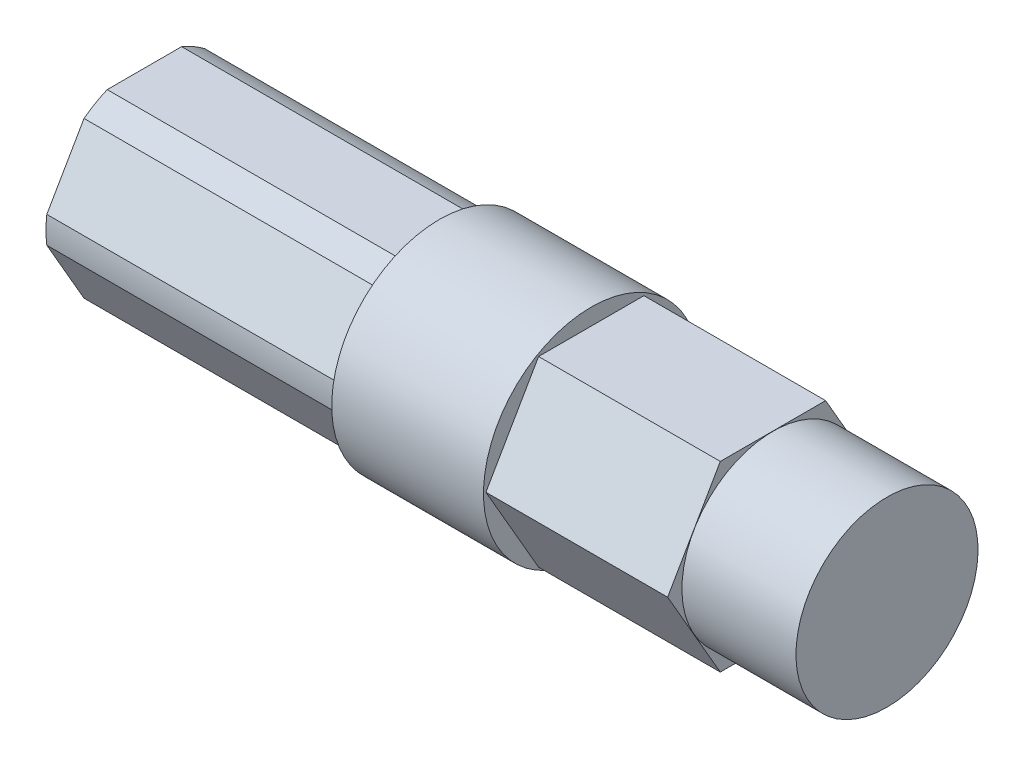
ISO-10303-21;
HEADER;
FILE_DESCRIPTION(('STEP AP214'),'2;1');
FILE_NAME('part.step','',(''),(''),'','','');
FILE_SCHEMA(('AUTOMOTIVE_DESIGN { 1 0 10303 214 1 1 1 1 }'));
ENDSEC;
DATA;
#1=APPLICATION_CONTEXT('core data for automotive mechanical design processes');
#2=APPLICATION_PROTOCOL_DEFINITION('international standard','automotive_design',2000,#1);
#3=PRODUCT_CONTEXT('',#1,'mechanical');
#4=PRODUCT('Part','Part','',(#3));
#5=PRODUCT_RELATED_PRODUCT_CATEGORY('part','',(#4));
#6=PRODUCT_DEFINITION_FORMATION('','',#4);
#7=PRODUCT_DEFINITION_CONTEXT('part definition',#1,'design');
#8=PRODUCT_DEFINITION('design','',#6,#7);
#9=PRODUCT_DEFINITION_SHAPE('','',#8);
#10=(LENGTH_UNIT() NAMED_UNIT(*) SI_UNIT(.MILLI.,.METRE.));
#11=(NAMED_UNIT(*) PLANE_ANGLE_UNIT() SI_UNIT($,.RADIAN.));
#12=(NAMED_UNIT(*) SI_UNIT($,.STERADIAN.) SOLID_ANGLE_UNIT());
#13=UNCERTAINTY_MEASURE_WITH_UNIT(LENGTH_MEASURE(1.E-05),#10,'distance_accuracy_value','');
#14=(GEOMETRIC_REPRESENTATION_CONTEXT(3) GLOBAL_UNCERTAINTY_ASSIGNED_CONTEXT((#13)) GLOBAL_UNIT_ASSIGNED_CONTEXT((#10,
#11,#12)) REPRESENTATION_CONTEXT('',''));
#15=CARTESIAN_POINT('',(0.,0.,0.));
#16=DIRECTION('',(0.,0.,1.));
#17=DIRECTION('',(1.,0.,0.));
#18=AXIS2_PLACEMENT_3D('',#15,#16,#17);
#19=CARTESIAN_POINT('',(-1.33985,0.,0.));
#20=DIRECTION('',(1.,0.,0.));
#21=DIRECTION('',(0.,1.,0.));
#22=AXIS2_PLACEMENT_3D('',#19,#20,#21);
#23=CYLINDRICAL_SURFACE('',#22,7.49999999999972);
#24=CARTESIAN_POINT('',(-1.33985,0.,0.));
#25=DIRECTION('',(1.,0.,0.));
#26=DIRECTION('',(0.,1.,0.));
#27=AXIS2_PLACEMENT_3D('',#24,#25,#26);
#28=CIRCLE('',#27,7.49999999999972);
#29=CARTESIAN_POINT('',(-1.33985,7.49999999999972,0.));
#30=VERTEX_POINT('',#29);
#31=EDGE_CURVE('E11',#30,#30,#28,.T.);
#32=ORIENTED_EDGE('',*,*,#31,.T.);
#33=EDGE_LOOP('',(#32));
#34=FACE_BOUND('',#33,.T.);
#35=CARTESIAN_POINT('',(9.22654999999914,0.,0.));
#36=DIRECTION('',(1.,0.,0.));
#37=DIRECTION('',(0.,1.,0.));
#38=AXIS2_PLACEMENT_3D('',#35,#36,#37);
#39=CIRCLE('',#38,7.49999999999972);
#40=CARTESIAN_POINT('',(9.22654999999914,7.49999999999972,0.));
#41=VERTEX_POINT('',#40);
#42=EDGE_CURVE('E47',#41,#41,#39,.T.);
#43=ORIENTED_EDGE('',*,*,#42,.F.);
#44=EDGE_LOOP('',(#43));
#45=FACE_BOUND('',#44,.T.);
#46=ADVANCED_FACE('F38',(#34,#45),#23,.T.);
#47=CARTESIAN_POINT('',(-1.33985,7.49999999999972,0.));
#48=DIRECTION('',(-1.,0.,0.));
#49=DIRECTION('',(0.,-1.,0.));
#50=AXIS2_PLACEMENT_3D('',#47,#48,#49);
#51=PLANE('',#50);
#52=CARTESIAN_POINT('',(-1.33985,0.,0.));
#53=DIRECTION('',(-1.,0.,0.));
#54=DIRECTION('',(0.,1.,0.));
#55=AXIS2_PLACEMENT_3D('',#52,#53,#54);
#56=CIRCLE('',#55,6.85799999999989);
#57=CARTESIAN_POINT('',(-1.33985,6.34999999999992,-2.59030191290504));
#58=VERTEX_POINT('',#57);
#59=CARTESIAN_POINT('',(-1.33985,5.41826726004726,-4.20411035757847));
#60=VERTEX_POINT('',#59);
#61=EDGE_CURVE('E252',#58,#60,#56,.T.);
#62=ORIENTED_EDGE('',*,*,#61,.F.);
#63=DIRECTION('',(0.,0.,-1.));
#64=VECTOR('',#63,1.);
#65=CARTESIAN_POINT('',(-1.33985,6.34999999999992,-2.59030191290504));
#66=LINE('',#65,#64);
#67=CARTESIAN_POINT('',(-1.33985,6.35,2.59030191290503));
#68=VERTEX_POINT('',#67);
#69=EDGE_CURVE('E258',#68,#58,#66,.T.);
#70=ORIENTED_EDGE('',*,*,#69,.F.);
#71=CARTESIAN_POINT('',(-1.33985,0.,0.));
#72=DIRECTION('',(-1.,0.,0.));
#73=DIRECTION('',(0.,1.,0.));
#74=AXIS2_PLACEMENT_3D('',#71,#72,#73);
#75=CIRCLE('',#74,6.85799999999992);
#76=CARTESIAN_POINT('',(-1.33985,5.41826726004731,4.20411035757845));
#77=VERTEX_POINT('',#76);
#78=EDGE_CURVE('E331',#77,#68,#75,.T.);
#79=ORIENTED_EDGE('',*,*,#78,.F.);
#80=DIRECTION('',(0.,0.866025403784429,-0.500000000000016));
#81=VECTOR('',#80,1.);
#82=CARTESIAN_POINT('',(-1.33985,5.41826726004728,4.20411035757842));
#83=LINE('',#82,#81);
#84=CARTESIAN_POINT('',(-1.33985,0.931732739952703,6.79441227048369));
#85=VERTEX_POINT('',#84);
#86=EDGE_CURVE('E327',#85,#77,#83,.T.);
#87=ORIENTED_EDGE('',*,*,#86,.F.);
#88=CARTESIAN_POINT('',(-1.33985,0.,0.));
#89=DIRECTION('',(-1.,0.,0.));
#90=DIRECTION('',(0.,1.,0.));
#91=AXIS2_PLACEMENT_3D('',#88,#89,#90);
#92=CIRCLE('',#91,6.85799999999993);
#93=CARTESIAN_POINT('',(-1.33985,-0.931732739952714,6.79441227048368));
#94=VERTEX_POINT('',#93);
#95=EDGE_CURVE('E323',#94,#85,#92,.T.);
#96=ORIENTED_EDGE('',*,*,#95,.F.);
#97=DIRECTION('',(0.,0.866025403784423,0.500000000000027));
#98=VECTOR('',#97,1.);
#99=CARTESIAN_POINT('',(-1.33985,-0.931732739952713,6.79441227048367));
#100=LINE('',#99,#98);
#101=CARTESIAN_POINT('',(-1.33985,-5.41826726004725,4.20411035757835));
#102=VERTEX_POINT('',#101);
#103=EDGE_CURVE('E319',#102,#94,#100,.T.);
#104=ORIENTED_EDGE('',*,*,#103,.F.);
#105=CARTESIAN_POINT('',(-1.33985,0.,0.));
#106=DIRECTION('',(-1.,0.,0.));
#107=DIRECTION('',(0.,1.,0.));
#108=AXIS2_PLACEMENT_3D('',#105,#106,#107);
#109=CIRCLE('',#108,6.85799999999985);
#110=CARTESIAN_POINT('',(-1.33985,-6.3499999999999,2.59030191290499));
#111=VERTEX_POINT('',#110);
#112=EDGE_CURVE('E315',#111,#102,#109,.T.);
#113=ORIENTED_EDGE('',*,*,#112,.F.);
#114=DIRECTION('',(0.,0.,1.));
#115=VECTOR('',#114,1.);
#116=CARTESIAN_POINT('',(-1.33985,-6.34999999999993,2.590301912905));
#117=LINE('',#116,#115);
#118=CARTESIAN_POINT('',(-1.33985,-6.35,-2.590301912905));
#119=VERTEX_POINT('',#118);
#120=EDGE_CURVE('E311',#119,#111,#117,.T.);
#121=ORIENTED_EDGE('',*,*,#120,.F.);
#122=CARTESIAN_POINT('',(-1.33985,0.,0.));
#123=DIRECTION('',(-1.,0.,0.));
#124=DIRECTION('',(0.,1.,0.));
#125=AXIS2_PLACEMENT_3D('',#122,#123,#124);
#126=CIRCLE('',#125,6.8579999999999);
#127=CARTESIAN_POINT('',(-1.33985,-5.41826726004732,-4.2041103575784));
#128=VERTEX_POINT('',#127);
#129=EDGE_CURVE('E307',#128,#119,#126,.T.);
#130=ORIENTED_EDGE('',*,*,#129,.F.);
#131=DIRECTION('',(0.,-0.866025403784439,0.499999999999999));
#132=VECTOR('',#131,1.);
#133=CARTESIAN_POINT('',(-1.33985,-5.41826726004728,-4.20411035757838));
#134=LINE('',#133,#132);
#135=CARTESIAN_POINT('',(-1.33985,-0.931732739952709,-6.79441227048352));
#136=VERTEX_POINT('',#135);
#137=EDGE_CURVE('E303',#136,#128,#134,.T.);
#138=ORIENTED_EDGE('',*,*,#137,.F.);
#139=CARTESIAN_POINT('',(-1.33985,0.,0.));
#140=DIRECTION('',(-1.,0.,0.));
#141=DIRECTION('',(0.,1.,0.));
#142=AXIS2_PLACEMENT_3D('',#139,#140,#141);
#143=CIRCLE('',#142,6.85799999999985);
#144=CARTESIAN_POINT('',(-1.33985,0.931732739952734,-6.7944122704836));
#145=VERTEX_POINT('',#144);
#146=EDGE_CURVE('E299',#145,#136,#143,.T.);
#147=ORIENTED_EDGE('',*,*,#146,.F.);
#148=DIRECTION('',(0.,-0.866025403784431,-0.500000000000013));
#149=VECTOR('',#148,1.);
#150=CARTESIAN_POINT('',(-1.33985,0.931732739952746,-6.79441227048368));
#151=LINE('',#150,#149);
#152=EDGE_CURVE('E295',#60,#145,#151,.T.);
#153=ORIENTED_EDGE('',*,*,#152,.F.);
#154=EDGE_LOOP('',(#62,#70,#79,#87,#96,#104,#113,#121,#130,#138,#147,#153));
#155=FACE_BOUND('',#154,.T.);
#156=ORIENTED_EDGE('',*,*,#31,.F.);
#157=EDGE_LOOP('',(#156));
#158=FACE_BOUND('',#157,.T.);
#159=ADVANCED_FACE('F392',(#155,#158),#51,.T.);
#160=CARTESIAN_POINT('',(9.22654999999914,0.,0.));
#161=DIRECTION('',(1.,0.,0.));
#162=DIRECTION('',(0.,1.,0.));
#163=AXIS2_PLACEMENT_3D('',#160,#161,#162);
#164=PLANE('',#163);
#165=DIRECTION('',(0.,0.866025403784442,-0.499999999999994));
#166=VECTOR('',#165,1.);
#167=CARTESIAN_POINT('',(9.22654999999914,1.12082512993195E-13,-7.33234841870804));
#168=LINE('',#167,#166);
#169=CARTESIAN_POINT('',(9.22654999999914,-6.34999999999988,-3.66617420935398));
#170=VERTEX_POINT('',#169);
#171=CARTESIAN_POINT('',(9.22654999999914,1.12082512993195E-13,-7.33234841870804));
#172=VERTEX_POINT('',#171);
#173=EDGE_CURVE('E54',#170,#172,#168,.T.);
#174=ORIENTED_EDGE('',*,*,#173,.F.);
#175=DIRECTION('',(0.,0.,-1.));
#176=VECTOR('',#175,1.);
#177=CARTESIAN_POINT('',(9.22654999999914,-6.34999999999988,-3.66617420935398));
#178=LINE('',#177,#176);
#179=CARTESIAN_POINT('',(9.22654999999914,-6.34999999999992,3.66617420935392));
#180=VERTEX_POINT('',#179);
#181=EDGE_CURVE('E58',#180,#170,#178,.T.);
#182=ORIENTED_EDGE('',*,*,#181,.F.);
#183=DIRECTION('',(0.,-0.866025403784443,-0.499999999999992));
#184=VECTOR('',#183,1.);
#185=CARTESIAN_POINT('',(9.22654999999914,-6.34999999999992,3.66617420935392));
#186=LINE('',#185,#184);
#187=CARTESIAN_POINT('',(9.22654999999914,0.,7.33234841870792));
#188=VERTEX_POINT('',#187);
#189=EDGE_CURVE('E224',#188,#180,#186,.T.);
#190=ORIENTED_EDGE('',*,*,#189,.F.);
#191=DIRECTION('',(0.,-0.866025403784445,0.499999999999988));
#192=VECTOR('',#191,1.);
#193=CARTESIAN_POINT('',(9.22654999999914,0.,7.33234841870792));
#194=LINE('',#193,#192);
#195=CARTESIAN_POINT('',(9.22654999999914,6.35,3.66617420935392));
#196=VERTEX_POINT('',#195);
#197=EDGE_CURVE('E220',#196,#188,#194,.T.);
#198=ORIENTED_EDGE('',*,*,#197,.F.);
#199=DIRECTION('',(0.,0.,1.));
#200=VECTOR('',#199,1.);
#201=CARTESIAN_POINT('',(9.22654999999914,6.35,3.66617420935392));
#202=LINE('',#201,#200);
#203=CARTESIAN_POINT('',(9.22654999999914,6.35,-3.66617420935401));
#204=VERTEX_POINT('',#203);
#205=EDGE_CURVE('E216',#204,#196,#202,.T.);
#206=ORIENTED_EDGE('',*,*,#205,.F.);
#207=DIRECTION('',(0.,0.86602540378444,0.499999999999997));
#208=VECTOR('',#207,1.);
#209=CARTESIAN_POINT('',(9.22654999999914,6.35,-3.66617420935401));
#210=LINE('',#209,#208);
#211=EDGE_CURVE('E212',#172,#204,#210,.T.);
#212=ORIENTED_EDGE('',*,*,#211,.F.);
#213=EDGE_LOOP('',(#174,#182,#190,#198,#206,#212));
#214=FACE_BOUND('',#213,.T.);
#215=ORIENTED_EDGE('',*,*,#42,.T.);
#216=EDGE_LOOP('',(#215));
#217=FACE_BOUND('',#216,.T.);
#218=ADVANCED_FACE('F389',(#214,#217),#164,.T.);
#219=CARTESIAN_POINT('',(-21.8757499999997,0.,0.));
#220=DIRECTION('',(1.,0.,0.));
#221=DIRECTION('',(0.,1.,0.));
#222=AXIS2_PLACEMENT_3D('',#219,#220,#221);
#223=CYLINDRICAL_SURFACE('',#222,6.85799999999989);
#224=ORIENTED_EDGE('',*,*,#61,.T.);
#225=DIRECTION('',(1.,0.,0.));
#226=VECTOR('',#225,1.);
#227=CARTESIAN_POINT('',(-21.8757499999997,5.41826726004726,-4.20411035757847));
#228=LINE('',#227,#226);
#229=CARTESIAN_POINT('',(-21.8757499999997,5.41826726004726,-4.20411035757847));
#230=VERTEX_POINT('',#229);
#231=EDGE_CURVE('E381',#230,#60,#228,.T.);
#232=ORIENTED_EDGE('',*,*,#231,.F.);
#233=CARTESIAN_POINT('',(-21.8757499999997,0.,0.));
#234=DIRECTION('',(-1.,0.,0.));
#235=DIRECTION('',(0.,1.,0.));
#236=AXIS2_PLACEMENT_3D('',#233,#234,#235);
#237=CIRCLE('',#236,6.85799999999989);
#238=CARTESIAN_POINT('',(-21.8757499999997,6.34999999999992,-2.59030191290504));
#239=VERTEX_POINT('',#238);
#240=EDGE_CURVE('E253',#239,#230,#237,.T.);
#241=ORIENTED_EDGE('',*,*,#240,.F.);
#242=DIRECTION('',(1.,0.,0.));
#243=VECTOR('',#242,1.);
#244=CARTESIAN_POINT('',(-21.8757499999997,6.34999999999992,-2.59030191290504));
#245=LINE('',#244,#243);
#246=EDGE_CURVE('E291',#239,#58,#245,.T.);
#247=ORIENTED_EDGE('',*,*,#246,.T.);
#248=EDGE_LOOP('',(#224,#232,#241,#247));
#249=FACE_BOUND('',#248,.T.);
#250=ADVANCED_FACE('F403',(#249),#223,.T.);
#251=CARTESIAN_POINT('',(-21.8757499999997,0.931732739952746,-6.79441227048368));
#252=DIRECTION('',(0.,-0.500000000000013,0.866025403784431));
#253=DIRECTION('',(0.,-0.866025403784431,-0.500000000000013));
#254=AXIS2_PLACEMENT_3D('',#251,#252,#253);
#255=PLANE('',#254);
#256=ORIENTED_EDGE('',*,*,#152,.T.);
#257=DIRECTION('',(1.,0.,0.));
#258=VECTOR('',#257,1.);
#259=CARTESIAN_POINT('',(-21.8757499999997,0.931732739952734,-6.7944122704836));
#260=LINE('',#259,#258);
#261=CARTESIAN_POINT('',(-21.8757499999997,0.931732739952734,-6.7944122704836));
#262=VERTEX_POINT('',#261);
#263=EDGE_CURVE('E377',#262,#145,#260,.T.);
#264=ORIENTED_EDGE('',*,*,#263,.F.);
#265=DIRECTION('',(0.,-0.866025403784431,-0.500000000000013));
#266=VECTOR('',#265,1.);
#267=CARTESIAN_POINT('',(-21.8757499999997,0.931732739952746,-6.79441227048368));
#268=LINE('',#267,#266);
#269=EDGE_CURVE('E257',#230,#262,#268,.T.);
#270=ORIENTED_EDGE('',*,*,#269,.F.);
#271=ORIENTED_EDGE('',*,*,#231,.T.);
#272=EDGE_LOOP('',(#256,#264,#270,#271));
#273=FACE_BOUND('',#272,.T.);
#274=ADVANCED_FACE('F408',(#273),#255,.F.);
#275=CARTESIAN_POINT('',(-21.8757499999997,0.,0.));
#276=DIRECTION('',(1.,0.,0.));
#277=DIRECTION('',(0.,1.,0.));
#278=AXIS2_PLACEMENT_3D('',#275,#276,#277);
#279=CYLINDRICAL_SURFACE('',#278,6.85799999999985);
#280=ORIENTED_EDGE('',*,*,#146,.T.);
#281=DIRECTION('',(1.,0.,0.));
#282=VECTOR('',#281,1.);
#283=CARTESIAN_POINT('',(-21.8757499999997,-0.931732739952709,-6.79441227048352));
#284=LINE('',#283,#282);
#285=CARTESIAN_POINT('',(-21.8757499999997,-0.931732739952709,-6.79441227048352));
#286=VERTEX_POINT('',#285);
#287=EDGE_CURVE('E373',#286,#136,#284,.T.);
#288=ORIENTED_EDGE('',*,*,#287,.F.);
#289=CARTESIAN_POINT('',(-21.8757499999997,0.,0.));
#290=DIRECTION('',(-1.,0.,0.));
#291=DIRECTION('',(0.,1.,0.));
#292=AXIS2_PLACEMENT_3D('',#289,#290,#291);
#293=CIRCLE('',#292,6.85799999999985);
#294=EDGE_CURVE('E261',#262,#286,#293,.T.);
#295=ORIENTED_EDGE('',*,*,#294,.F.);
#296=ORIENTED_EDGE('',*,*,#263,.T.);
#297=EDGE_LOOP('',(#280,#288,#295,#296));
#298=FACE_BOUND('',#297,.T.);
#299=ADVANCED_FACE('F412',(#298),#279,.T.);
#300=CARTESIAN_POINT('',(-21.8757499999997,-5.41826726004728,-4.20411035757838));
#301=DIRECTION('',(0.,0.499999999999999,0.866025403784439));
#302=DIRECTION('',(0.,-0.866025403784439,0.499999999999999));
#303=AXIS2_PLACEMENT_3D('',#300,#301,#302);
#304=PLANE('',#303);
#305=ORIENTED_EDGE('',*,*,#137,.T.);
#306=DIRECTION('',(1.,0.,0.));
#307=VECTOR('',#306,1.);
#308=CARTESIAN_POINT('',(-21.8757499999997,-5.41826726004732,-4.2041103575784));
#309=LINE('',#308,#307);
#310=CARTESIAN_POINT('',(-21.8757499999997,-5.41826726004732,-4.2041103575784));
#311=VERTEX_POINT('',#310);
#312=EDGE_CURVE('E369',#311,#128,#309,.T.);
#313=ORIENTED_EDGE('',*,*,#312,.F.);
#314=DIRECTION('',(0.,-0.866025403784439,0.499999999999999));
#315=VECTOR('',#314,1.);
#316=CARTESIAN_POINT('',(-21.8757499999997,-5.41826726004728,-4.20411035757838));
#317=LINE('',#316,#315);
#318=EDGE_CURVE('E264',#286,#311,#317,.T.);
#319=ORIENTED_EDGE('',*,*,#318,.F.);
#320=ORIENTED_EDGE('',*,*,#287,.T.);
#321=EDGE_LOOP('',(#305,#313,#319,#320));
#322=FACE_BOUND('',#321,.T.);
#323=ADVANCED_FACE('F416',(#322),#304,.F.);
#324=CARTESIAN_POINT('',(-21.8757499999997,0.,0.));
#325=DIRECTION('',(1.,0.,0.));
#326=DIRECTION('',(0.,1.,0.));
#327=AXIS2_PLACEMENT_3D('',#324,#325,#326);
#328=CYLINDRICAL_SURFACE('',#327,6.8579999999999);
#329=ORIENTED_EDGE('',*,*,#129,.T.);
#330=DIRECTION('',(1.,0.,0.));
#331=VECTOR('',#330,1.);
#332=CARTESIAN_POINT('',(-21.8757499999997,-6.35,-2.590301912905));
#333=LINE('',#332,#331);
#334=CARTESIAN_POINT('',(-21.8757499999997,-6.35,-2.590301912905));
#335=VERTEX_POINT('',#334);
#336=EDGE_CURVE('E365',#335,#119,#333,.T.);
#337=ORIENTED_EDGE('',*,*,#336,.F.);
#338=CARTESIAN_POINT('',(-21.8757499999997,0.,0.));
#339=DIRECTION('',(-1.,0.,0.));
#340=DIRECTION('',(0.,1.,0.));
#341=AXIS2_PLACEMENT_3D('',#338,#339,#340);
#342=CIRCLE('',#341,6.8579999999999);
#343=EDGE_CURVE('E267',#311,#335,#342,.T.);
#344=ORIENTED_EDGE('',*,*,#343,.F.);
#345=ORIENTED_EDGE('',*,*,#312,.T.);
#346=EDGE_LOOP('',(#329,#337,#344,#345));
#347=FACE_BOUND('',#346,.T.);
#348=ADVANCED_FACE('F420',(#347),#328,.T.);
#349=CARTESIAN_POINT('',(-21.8757499999997,-6.34999999999993,2.590301912905));
#350=DIRECTION('',(0.,1.,0.));
#351=DIRECTION('',(0.,0.,1.));
#352=AXIS2_PLACEMENT_3D('',#349,#350,#351);
#353=PLANE('',#352);
#354=ORIENTED_EDGE('',*,*,#120,.T.);
#355=DIRECTION('',(1.,0.,0.));
#356=VECTOR('',#355,1.);
#357=CARTESIAN_POINT('',(-21.8757499999997,-6.3499999999999,2.59030191290499));
#358=LINE('',#357,#356);
#359=CARTESIAN_POINT('',(-21.8757499999997,-6.3499999999999,2.59030191290499));
#360=VERTEX_POINT('',#359);
#361=EDGE_CURVE('E361',#360,#111,#358,.T.);
#362=ORIENTED_EDGE('',*,*,#361,.F.);
#363=DIRECTION('',(0.,0.,1.));
#364=VECTOR('',#363,1.);
#365=CARTESIAN_POINT('',(-21.8757499999997,-6.34999999999993,2.590301912905));
#366=LINE('',#365,#364);
#367=EDGE_CURVE('E270',#335,#360,#366,.T.);
#368=ORIENTED_EDGE('',*,*,#367,.F.);
#369=ORIENTED_EDGE('',*,*,#336,.T.);
#370=EDGE_LOOP('',(#354,#362,#368,#369));
#371=FACE_BOUND('',#370,.T.);
#372=ADVANCED_FACE('F424',(#371),#353,.F.);
#373=CARTESIAN_POINT('',(-21.8757499999997,0.,0.));
#374=DIRECTION('',(1.,0.,0.));
#375=DIRECTION('',(0.,1.,0.));
#376=AXIS2_PLACEMENT_3D('',#373,#374,#375);
#377=CYLINDRICAL_SURFACE('',#376,6.85799999999985);
#378=ORIENTED_EDGE('',*,*,#112,.T.);
#379=DIRECTION('',(1.,0.,0.));
#380=VECTOR('',#379,1.);
#381=CARTESIAN_POINT('',(-21.8757499999997,-5.41826726004725,4.20411035757835));
#382=LINE('',#381,#380);
#383=CARTESIAN_POINT('',(-21.8757499999997,-5.41826726004725,4.20411035757835));
#384=VERTEX_POINT('',#383);
#385=EDGE_CURVE('E357',#384,#102,#382,.T.);
#386=ORIENTED_EDGE('',*,*,#385,.F.);
#387=CARTESIAN_POINT('',(-21.8757499999997,0.,0.));
#388=DIRECTION('',(-1.,0.,0.));
#389=DIRECTION('',(0.,1.,0.));
#390=AXIS2_PLACEMENT_3D('',#387,#388,#389);
#391=CIRCLE('',#390,6.85799999999985);
#392=EDGE_CURVE('E273',#360,#384,#391,.T.);
#393=ORIENTED_EDGE('',*,*,#392,.F.);
#394=ORIENTED_EDGE('',*,*,#361,.T.);
#395=EDGE_LOOP('',(#378,#386,#393,#394));
#396=FACE_BOUND('',#395,.T.);
#397=ADVANCED_FACE('F428',(#396),#377,.T.);
#398=CARTESIAN_POINT('',(-21.8757499999997,-0.931732739952713,6.79441227048367));
#399=DIRECTION('',(0.,0.500000000000027,-0.866025403784423));
#400=DIRECTION('',(0.,0.866025403784423,0.500000000000027));
#401=AXIS2_PLACEMENT_3D('',#398,#399,#400);
#402=PLANE('',#401);
#403=ORIENTED_EDGE('',*,*,#103,.T.);
#404=DIRECTION('',(1.,0.,0.));
#405=VECTOR('',#404,1.);
#406=CARTESIAN_POINT('',(-21.8757499999997,-0.931732739952714,6.79441227048368));
#407=LINE('',#406,#405);
#408=CARTESIAN_POINT('',(-21.8757499999997,-0.931732739952714,6.79441227048368));
#409=VERTEX_POINT('',#408);
#410=EDGE_CURVE('E353',#409,#94,#407,.T.);
#411=ORIENTED_EDGE('',*,*,#410,.F.);
#412=DIRECTION('',(0.,0.866025403784423,0.500000000000027));
#413=VECTOR('',#412,1.);
#414=CARTESIAN_POINT('',(-21.8757499999997,-0.931732739952713,6.79441227048367));
#415=LINE('',#414,#413);
#416=EDGE_CURVE('E276',#384,#409,#415,.T.);
#417=ORIENTED_EDGE('',*,*,#416,.F.);
#418=ORIENTED_EDGE('',*,*,#385,.T.);
#419=EDGE_LOOP('',(#403,#411,#417,#418));
#420=FACE_BOUND('',#419,.T.);
#421=ADVANCED_FACE('F432',(#420),#402,.F.);
#422=CARTESIAN_POINT('',(-21.8757499999997,0.,0.));
#423=DIRECTION('',(1.,0.,0.));
#424=DIRECTION('',(0.,1.,0.));
#425=AXIS2_PLACEMENT_3D('',#422,#423,#424);
#426=CYLINDRICAL_SURFACE('',#425,6.85799999999993);
#427=ORIENTED_EDGE('',*,*,#95,.T.);
#428=DIRECTION('',(1.,0.,0.));
#429=VECTOR('',#428,1.);
#430=CARTESIAN_POINT('',(-21.8757499999997,0.931732739952703,6.79441227048369));
#431=LINE('',#430,#429);
#432=CARTESIAN_POINT('',(-21.8757499999997,0.931732739952703,6.79441227048369));
#433=VERTEX_POINT('',#432);
#434=EDGE_CURVE('E349',#433,#85,#431,.T.);
#435=ORIENTED_EDGE('',*,*,#434,.F.);
#436=CARTESIAN_POINT('',(-21.8757499999997,0.,0.));
#437=DIRECTION('',(-1.,0.,0.));
#438=DIRECTION('',(0.,1.,0.));
#439=AXIS2_PLACEMENT_3D('',#436,#437,#438);
#440=CIRCLE('',#439,6.85799999999993);
#441=EDGE_CURVE('E279',#409,#433,#440,.T.);
#442=ORIENTED_EDGE('',*,*,#441,.F.);
#443=ORIENTED_EDGE('',*,*,#410,.T.);
#444=EDGE_LOOP('',(#427,#435,#442,#443));
#445=FACE_BOUND('',#444,.T.);
#446=ADVANCED_FACE('F436',(#445),#426,.T.);
#447=CARTESIAN_POINT('',(-21.8757499999997,5.41826726004728,4.20411035757842));
#448=DIRECTION('',(0.,-0.500000000000016,-0.86602540378443));
#449=DIRECTION('',(0.,0.86602540378443,-0.500000000000016));
#450=AXIS2_PLACEMENT_3D('',#447,#448,#449);
#451=PLANE('',#450);
#452=ORIENTED_EDGE('',*,*,#86,.T.);
#453=DIRECTION('',(1.,0.,0.));
#454=VECTOR('',#453,1.);
#455=CARTESIAN_POINT('',(-21.8757499999997,5.41826726004731,4.20411035757845));
#456=LINE('',#455,#454);
#457=CARTESIAN_POINT('',(-21.8757499999997,5.41826726004731,4.20411035757845));
#458=VERTEX_POINT('',#457);
#459=EDGE_CURVE('E345',#458,#77,#456,.T.);
#460=ORIENTED_EDGE('',*,*,#459,.F.);
#461=DIRECTION('',(0.,0.866025403784429,-0.500000000000016));
#462=VECTOR('',#461,1.);
#463=CARTESIAN_POINT('',(-21.8757499999997,5.41826726004728,4.20411035757842));
#464=LINE('',#463,#462);
#465=EDGE_CURVE('E282',#433,#458,#464,.T.);
#466=ORIENTED_EDGE('',*,*,#465,.F.);
#467=ORIENTED_EDGE('',*,*,#434,.T.);
#468=EDGE_LOOP('',(#452,#460,#466,#467));
#469=FACE_BOUND('',#468,.T.);
#470=ADVANCED_FACE('F440',(#469),#451,.F.);
#471=CARTESIAN_POINT('',(-21.8757499999997,0.,0.));
#472=DIRECTION('',(1.,0.,0.));
#473=DIRECTION('',(0.,1.,0.));
#474=AXIS2_PLACEMENT_3D('',#471,#472,#473);
#475=CYLINDRICAL_SURFACE('',#474,6.85799999999992);
#476=ORIENTED_EDGE('',*,*,#78,.T.);
#477=DIRECTION('',(1.,0.,0.));
#478=VECTOR('',#477,1.);
#479=CARTESIAN_POINT('',(-21.8757499999997,6.35,2.59030191290503));
#480=LINE('',#479,#478);
#481=CARTESIAN_POINT('',(-21.8757499999997,6.35,2.59030191290503));
#482=VERTEX_POINT('',#481);
#483=EDGE_CURVE('E341',#482,#68,#480,.T.);
#484=ORIENTED_EDGE('',*,*,#483,.F.);
#485=CARTESIAN_POINT('',(-21.8757499999997,0.,0.));
#486=DIRECTION('',(-1.,0.,0.));
#487=DIRECTION('',(0.,1.,0.));
#488=AXIS2_PLACEMENT_3D('',#485,#486,#487);
#489=CIRCLE('',#488,6.85799999999992);
#490=EDGE_CURVE('E285',#458,#482,#489,.T.);
#491=ORIENTED_EDGE('',*,*,#490,.F.);
#492=ORIENTED_EDGE('',*,*,#459,.T.);
#493=EDGE_LOOP('',(#476,#484,#491,#492));
#494=FACE_BOUND('',#493,.T.);
#495=ADVANCED_FACE('F444',(#494),#475,.T.);
#496=CARTESIAN_POINT('',(-21.8757499999997,6.34999999999992,-2.59030191290504));
#497=DIRECTION('',(0.,-1.,0.));
#498=DIRECTION('',(0.,0.,-1.));
#499=AXIS2_PLACEMENT_3D('',#496,#497,#498);
#500=PLANE('',#499);
#501=ORIENTED_EDGE('',*,*,#69,.T.);
#502=ORIENTED_EDGE('',*,*,#246,.F.);
#503=DIRECTION('',(0.,0.,-1.));
#504=VECTOR('',#503,1.);
#505=CARTESIAN_POINT('',(-21.8757499999997,6.34999999999992,-2.59030191290504));
#506=LINE('',#505,#504);
#507=EDGE_CURVE('E288',#482,#239,#506,.T.);
#508=ORIENTED_EDGE('',*,*,#507,.F.);
#509=ORIENTED_EDGE('',*,*,#483,.T.);
#510=EDGE_LOOP('',(#501,#502,#508,#509));
#511=FACE_BOUND('',#510,.T.);
#512=ADVANCED_FACE('F448',(#511),#500,.F.);
#513=CARTESIAN_POINT('',(-21.8757499999997,0.,0.));
#514=DIRECTION('',(1.,0.,0.));
#515=DIRECTION('',(0.,1.,0.));
#516=AXIS2_PLACEMENT_3D('',#513,#514,#515);
#517=PLANE('',#516);
#518=CARTESIAN_POINT('',(-21.8757499999997,0.,0.));
#519=DIRECTION('',(-1.,0.,0.));
#520=DIRECTION('',(0.,-1.,0.));
#521=AXIS2_PLACEMENT_3D('',#518,#519,#520);
#522=CIRCLE('',#521,3.175);
#523=CARTESIAN_POINT('',(-21.8757499999997,-3.175,0.));
#524=VERTEX_POINT('',#523);
#525=EDGE_CURVE('E184',#524,#524,#522,.T.);
#526=ORIENTED_EDGE('',*,*,#525,.F.);
#527=EDGE_LOOP('',(#526));
#528=FACE_BOUND('',#527,.T.);
#529=ORIENTED_EDGE('',*,*,#240,.T.);
#530=ORIENTED_EDGE('',*,*,#269,.T.);
#531=ORIENTED_EDGE('',*,*,#294,.T.);
#532=ORIENTED_EDGE('',*,*,#318,.T.);
#533=ORIENTED_EDGE('',*,*,#343,.T.);
#534=ORIENTED_EDGE('',*,*,#367,.T.);
#535=ORIENTED_EDGE('',*,*,#392,.T.);
#536=ORIENTED_EDGE('',*,*,#416,.T.);
#537=ORIENTED_EDGE('',*,*,#441,.T.);
#538=ORIENTED_EDGE('',*,*,#465,.T.);
#539=ORIENTED_EDGE('',*,*,#490,.T.);
#540=ORIENTED_EDGE('',*,*,#507,.T.);
#541=EDGE_LOOP('',(#529,#530,#531,#532,#533,#534,#535,#536,#537,#538,#539,#540));
#542=FACE_BOUND('',#541,.T.);
#543=ADVANCED_FACE('F452',(#528,#542),#517,.F.);
#544=CARTESIAN_POINT('',(21.8757499999992,1.12082512993195E-13,-7.33234841870804));
#545=DIRECTION('',(0.,0.499999999999994,0.866025403784442));
#546=DIRECTION('',(0.,-0.866025403784442,0.499999999999994));
#547=AXIS2_PLACEMENT_3D('',#544,#545,#546);
#548=PLANE('',#547);
#549=ORIENTED_EDGE('',*,*,#173,.T.);
#550=DIRECTION('',(-1.,0.,0.));
#551=VECTOR('',#550,1.);
#552=CARTESIAN_POINT('',(21.8757499999992,1.12082512993195E-13,-7.33234841870804));
#553=LINE('',#552,#551);
#554=CARTESIAN_POINT('',(21.8757499999992,1.12082512993195E-13,-7.33234841870804));
#555=VERTEX_POINT('',#554);
#556=EDGE_CURVE('E248',#555,#172,#553,.T.);
#557=ORIENTED_EDGE('',*,*,#556,.F.);
#558=DIRECTION('',(0.,0.866025403784442,-0.499999999999994));
#559=VECTOR('',#558,1.);
#560=CARTESIAN_POINT('',(21.8757499999992,1.12082512993195E-13,-7.33234841870804));
#561=LINE('',#560,#559);
#562=CARTESIAN_POINT('',(21.8757499999992,-6.34999999999988,-3.66617420935398));
#563=VERTEX_POINT('',#562);
#564=EDGE_CURVE('E190',#563,#555,#561,.T.);
#565=ORIENTED_EDGE('',*,*,#564,.F.);
#566=DIRECTION('',(-1.,0.,0.));
#567=VECTOR('',#566,1.);
#568=CARTESIAN_POINT('',(21.8757499999992,-6.34999999999988,-3.66617420935398));
#569=LINE('',#568,#567);
#570=EDGE_CURVE('E209',#563,#170,#569,.T.);
#571=ORIENTED_EDGE('',*,*,#570,.T.);
#572=EDGE_LOOP('',(#549,#557,#565,#571));
#573=FACE_BOUND('',#572,.T.);
#574=ADVANCED_FACE('F456',(#573),#548,.F.);
#575=CARTESIAN_POINT('',(21.8757499999992,6.35,-3.66617420935401));
#576=DIRECTION('',(0.,-0.499999999999997,0.86602540378444));
#577=DIRECTION('',(0.,-0.86602540378444,-0.499999999999997));
#578=AXIS2_PLACEMENT_3D('',#575,#576,#577);
#579=PLANE('',#578);
#580=ORIENTED_EDGE('',*,*,#211,.T.);
#581=DIRECTION('',(-1.,0.,0.));
#582=VECTOR('',#581,1.);
#583=CARTESIAN_POINT('',(21.8757499999992,6.35,-3.66617420935401));
#584=LINE('',#583,#582);
#585=CARTESIAN_POINT('',(21.8757499999992,6.35,-3.66617420935401));
#586=VERTEX_POINT('',#585);
#587=EDGE_CURVE('E244',#586,#204,#584,.T.);
#588=ORIENTED_EDGE('',*,*,#587,.F.);
#589=DIRECTION('',(0.,0.86602540378444,0.499999999999997));
#590=VECTOR('',#589,1.);
#591=CARTESIAN_POINT('',(21.8757499999992,6.35,-3.66617420935401));
#592=LINE('',#591,#590);
#593=EDGE_CURVE('E194',#555,#586,#592,.T.);
#594=ORIENTED_EDGE('',*,*,#593,.F.);
#595=ORIENTED_EDGE('',*,*,#556,.T.);
#596=EDGE_LOOP('',(#580,#588,#594,#595));
#597=FACE_BOUND('',#596,.T.);
#598=ADVANCED_FACE('F460',(#597),#579,.F.);
#599=CARTESIAN_POINT('',(21.8757499999992,6.35,3.66617420935392));
#600=DIRECTION('',(0.,-1.,0.));
#601=DIRECTION('',(1.,0.,0.));
#602=AXIS2_PLACEMENT_3D('',#599,#600,#601);
#603=PLANE('',#602);
#604=ORIENTED_EDGE('',*,*,#205,.T.);
#605=DIRECTION('',(-1.,0.,0.));
#606=VECTOR('',#605,1.);
#607=CARTESIAN_POINT('',(21.8757499999992,6.35,3.66617420935392));
#608=LINE('',#607,#606);
#609=CARTESIAN_POINT('',(21.8757499999992,6.35,3.66617420935392));
#610=VERTEX_POINT('',#609);
#611=EDGE_CURVE('E240',#610,#196,#608,.T.);
#612=ORIENTED_EDGE('',*,*,#611,.F.);
#613=DIRECTION('',(0.,0.,1.));
#614=VECTOR('',#613,1.);
#615=CARTESIAN_POINT('',(21.8757499999992,6.35,3.66617420935392));
#616=LINE('',#615,#614);
#617=EDGE_CURVE('E197',#586,#610,#616,.T.);
#618=ORIENTED_EDGE('',*,*,#617,.F.);
#619=ORIENTED_EDGE('',*,*,#587,.T.);
#620=EDGE_LOOP('',(#604,#612,#618,#619));
#621=FACE_BOUND('',#620,.T.);
#622=ADVANCED_FACE('F464',(#621),#603,.F.);
#623=CARTESIAN_POINT('',(21.8757499999992,0.,7.33234841870792));
#624=DIRECTION('',(0.,-0.499999999999988,-0.866025403784445));
#625=DIRECTION('',(0.,0.866025403784445,-0.499999999999988));
#626=AXIS2_PLACEMENT_3D('',#623,#624,#625);
#627=PLANE('',#626);
#628=ORIENTED_EDGE('',*,*,#197,.T.);
#629=DIRECTION('',(-1.,0.,0.));
#630=VECTOR('',#629,1.);
#631=CARTESIAN_POINT('',(21.8757499999992,0.,7.33234841870792));
#632=LINE('',#631,#630);
#633=CARTESIAN_POINT('',(21.8757499999992,0.,7.33234841870792));
#634=VERTEX_POINT('',#633);
#635=EDGE_CURVE('E236',#634,#188,#632,.T.);
#636=ORIENTED_EDGE('',*,*,#635,.F.);
#637=DIRECTION('',(0.,-0.866025403784445,0.499999999999988));
#638=VECTOR('',#637,1.);
#639=CARTESIAN_POINT('',(21.8757499999992,0.,7.33234841870792));
#640=LINE('',#639,#638);
#641=EDGE_CURVE('E200',#610,#634,#640,.T.);
#642=ORIENTED_EDGE('',*,*,#641,.F.);
#643=ORIENTED_EDGE('',*,*,#611,.T.);
#644=EDGE_LOOP('',(#628,#636,#642,#643));
#645=FACE_BOUND('',#644,.T.);
#646=ADVANCED_FACE('F468',(#645),#627,.F.);
#647=CARTESIAN_POINT('',(21.8757499999992,-6.34999999999992,3.66617420935392));
#648=DIRECTION('',(0.,0.499999999999992,-0.866025403784443));
#649=DIRECTION('',(0.,0.866025403784443,0.499999999999992));
#650=AXIS2_PLACEMENT_3D('',#647,#648,#649);
#651=PLANE('',#650);
#652=ORIENTED_EDGE('',*,*,#189,.T.);
#653=DIRECTION('',(-1.,0.,0.));
#654=VECTOR('',#653,1.);
#655=CARTESIAN_POINT('',(21.8757499999992,-6.34999999999992,3.66617420935392));
#656=LINE('',#655,#654);
#657=CARTESIAN_POINT('',(21.8757499999992,-6.34999999999992,3.66617420935392));
#658=VERTEX_POINT('',#657);
#659=EDGE_CURVE('E232',#658,#180,#656,.T.);
#660=ORIENTED_EDGE('',*,*,#659,.F.);
#661=DIRECTION('',(0.,-0.866025403784443,-0.499999999999992));
#662=VECTOR('',#661,1.);
#663=CARTESIAN_POINT('',(21.8757499999992,-6.34999999999992,3.66617420935392));
#664=LINE('',#663,#662);
#665=EDGE_CURVE('E203',#634,#658,#664,.T.);
#666=ORIENTED_EDGE('',*,*,#665,.F.);
#667=ORIENTED_EDGE('',*,*,#635,.T.);
#668=EDGE_LOOP('',(#652,#660,#666,#667));
#669=FACE_BOUND('',#668,.T.);
#670=ADVANCED_FACE('F472',(#669),#651,.F.);
#671=CARTESIAN_POINT('',(21.8757499999992,-6.34999999999988,-3.66617420935398));
#672=DIRECTION('',(0.,1.,0.));
#673=DIRECTION('',(0.,0.,1.));
#674=AXIS2_PLACEMENT_3D('',#671,#672,#673);
#675=PLANE('',#674);
#676=ORIENTED_EDGE('',*,*,#181,.T.);
#677=ORIENTED_EDGE('',*,*,#570,.F.);
#678=DIRECTION('',(0.,0.,-1.));
#679=VECTOR('',#678,1.);
#680=CARTESIAN_POINT('',(21.8757499999992,-6.34999999999988,-3.66617420935398));
#681=LINE('',#680,#679);
#682=EDGE_CURVE('E206',#658,#563,#681,.T.);
#683=ORIENTED_EDGE('',*,*,#682,.F.);
#684=ORIENTED_EDGE('',*,*,#659,.T.);
#685=EDGE_LOOP('',(#676,#677,#683,#684));
#686=FACE_BOUND('',#685,.T.);
#687=ADVANCED_FACE('F476',(#686),#675,.F.);
#688=CARTESIAN_POINT('',(21.8757499999992,0.,0.));
#689=DIRECTION('',(-1.,0.,0.));
#690=DIRECTION('',(0.,0.,1.));
#691=AXIS2_PLACEMENT_3D('',#688,#689,#690);
#692=PLANE('',#691);
#693=CARTESIAN_POINT('',(21.8757499999992,0.,0.));
#694=DIRECTION('',(-1.,0.,0.));
#695=DIRECTION('',(0.,-1.,0.));
#696=AXIS2_PLACEMENT_3D('',#693,#694,#695);
#697=CIRCLE('',#696,6.33729999999976);
#698=CARTESIAN_POINT('',(21.8757499999992,-6.33729999999976,0.));
#699=VERTEX_POINT('',#698);
#700=EDGE_CURVE('E174',#699,#699,#697,.T.);
#701=ORIENTED_EDGE('',*,*,#700,.T.);
#702=EDGE_LOOP('',(#701));
#703=FACE_BOUND('',#702,.T.);
#704=ORIENTED_EDGE('',*,*,#564,.T.);
#705=ORIENTED_EDGE('',*,*,#593,.T.);
#706=ORIENTED_EDGE('',*,*,#617,.T.);
#707=ORIENTED_EDGE('',*,*,#641,.T.);
#708=ORIENTED_EDGE('',*,*,#665,.T.);
#709=ORIENTED_EDGE('',*,*,#682,.T.);
#710=EDGE_LOOP('',(#704,#705,#706,#707,#708,#709));
#711=FACE_BOUND('',#710,.T.);
#712=ADVANCED_FACE('F480',(#703,#711),#692,.F.);
#713=CARTESIAN_POINT('',(29.8132499999987,0.,0.));
#714=DIRECTION('',(-1.,0.,0.));
#715=DIRECTION('',(0.,-1.,0.));
#716=AXIS2_PLACEMENT_3D('',#713,#714,#715);
#717=CYLINDRICAL_SURFACE('',#716,6.33729999999976);
#718=CARTESIAN_POINT('',(29.8132499999987,0.,0.));
#719=DIRECTION('',(-1.,0.,0.));
#720=DIRECTION('',(0.,-1.,0.));
#721=AXIS2_PLACEMENT_3D('',#718,#719,#720);
#722=CIRCLE('',#721,6.33729999999976);
#723=CARTESIAN_POINT('',(29.8132499999987,-6.33729999999976,0.));
#724=VERTEX_POINT('',#723);
#725=EDGE_CURVE('E179',#724,#724,#722,.T.);
#726=ORIENTED_EDGE('',*,*,#725,.T.);
#727=EDGE_LOOP('',(#726));
#728=FACE_BOUND('',#727,.T.);
#729=ORIENTED_EDGE('',*,*,#700,.F.);
#730=EDGE_LOOP('',(#729));
#731=FACE_BOUND('',#730,.T.);
#732=ADVANCED_FACE('F484',(#728,#731),#717,.T.);
#733=CARTESIAN_POINT('',(29.8132499999987,6.33729999999976,0.));
#734=DIRECTION('',(1.,0.,0.));
#735=DIRECTION('',(0.,1.,0.));
#736=AXIS2_PLACEMENT_3D('',#733,#734,#735);
#737=PLANE('',#736);
#738=ORIENTED_EDGE('',*,*,#725,.F.);
#739=EDGE_LOOP('',(#738));
#740=FACE_BOUND('',#739,.T.);
#741=ADVANCED_FACE('F488',(#740),#737,.T.);
#742=CARTESIAN_POINT('',(-9.1757499999997,0.,0.));
#743=DIRECTION('',(-1.,0.,0.));
#744=DIRECTION('',(0.,-1.,0.));
#745=AXIS2_PLACEMENT_3D('',#742,#743,#744);
#746=PLANE('',#745);
#747=CARTESIAN_POINT('',(-9.1757499999997,0.,0.));
#748=DIRECTION('',(-1.,0.,0.));
#749=DIRECTION('',(0.,-1.,0.));
#750=AXIS2_PLACEMENT_3D('',#747,#748,#749);
#751=CIRCLE('',#750,3.175);
#752=CARTESIAN_POINT('',(-9.1757499999997,-3.175,0.));
#753=VERTEX_POINT('',#752);
#754=EDGE_CURVE('E182',#753,#753,#751,.T.);
#755=ORIENTED_EDGE('',*,*,#754,.T.);
#756=EDGE_LOOP('',(#755));
#757=FACE_BOUND('',#756,.T.);
#758=CARTESIAN_POINT('',(-9.1757499999997,0.,0.));
#759=DIRECTION('',(-1.,0.,0.));
#760=DIRECTION('',(0.,-1.,0.));
#761=AXIS2_PLACEMENT_3D('',#758,#759,#760);
#762=CIRCLE('',#761,2.01929999999991);
#763=CARTESIAN_POINT('',(-9.1757499999997,-2.01929999999991,0.));
#764=VERTEX_POINT('',#763);
#765=EDGE_CURVE('E41',#764,#764,#762,.F.);
#766=ORIENTED_EDGE('',*,*,#765,.T.);
#767=EDGE_LOOP('',(#766));
#768=FACE_BOUND('',#767,.T.);
#769=ADVANCED_FACE('F491',(#757,#768),#746,.T.);
#770=CARTESIAN_POINT('',(-9.1757499999997,0.,0.));
#771=DIRECTION('',(-1.,0.,0.));
#772=DIRECTION('',(0.,-1.,0.));
#773=AXIS2_PLACEMENT_3D('',#770,#771,#772);
#774=CYLINDRICAL_SURFACE('',#773,3.175);
#775=ORIENTED_EDGE('',*,*,#754,.F.);
#776=EDGE_LOOP('',(#775));
#777=FACE_BOUND('',#776,.T.);
#778=ORIENTED_EDGE('',*,*,#525,.T.);
#779=EDGE_LOOP('',(#778));
#780=FACE_BOUND('',#779,.T.);
#781=ADVANCED_FACE('F167',(#777,#780),#774,.F.);
#782=CARTESIAN_POINT('',(-6.00074999999972,0.,0.));
#783=DIRECTION('',(-1.,0.,0.));
#784=DIRECTION('',(0.,0.,1.));
#785=AXIS2_PLACEMENT_3D('',#782,#783,#784);
#786=CONICAL_SURFACE('',#785,2.01929999999991,1.02974425867665);
#787=CARTESIAN_POINT('',(-4.78743215199742,0.,0.));
#788=VERTEX_POINT('',#787);
#789=VERTEX_LOOP('',#788);
#790=FACE_BOUND('',#789,.T.);
#791=CARTESIAN_POINT('',(-6.00074999999972,0.,0.));
#792=DIRECTION('',(-1.,0.,0.));
#793=DIRECTION('',(0.,0.,1.));
#794=AXIS2_PLACEMENT_3D('',#791,#792,#793);
#795=CIRCLE('',#794,2.01929999999991);
#796=CARTESIAN_POINT('',(-6.00074999999972,0.,2.01929999999991));
#797=VERTEX_POINT('',#796);
#798=EDGE_CURVE('E171',#797,#797,#795,.T.);
#799=ORIENTED_EDGE('',*,*,#798,.T.);
#800=EDGE_LOOP('',(#799));
#801=FACE_BOUND('',#800,.T.);
#802=ADVANCED_FACE('F163',(#790,#801),#786,.F.);
#803=CARTESIAN_POINT('',(-21.8757499999997,0.,0.));
#804=DIRECTION('',(-1.,0.,0.));
#805=DIRECTION('',(0.,0.,1.));
#806=AXIS2_PLACEMENT_3D('',#803,#804,#805);
#807=CYLINDRICAL_SURFACE('',#806,2.01929999999991);
#808=ORIENTED_EDGE('',*,*,#798,.F.);
#809=EDGE_LOOP('',(#808));
#810=FACE_BOUND('',#809,.T.);
#811=ORIENTED_EDGE('',*,*,#765,.F.);
#812=EDGE_LOOP('',(#811));
#813=FACE_BOUND('',#812,.T.);
#814=ADVANCED_FACE('F166',(#810,#813),#807,.F.);
#815=CLOSED_SHELL('',(#46,#159,#218,#250,#274,#299,#323,#348,#372,#397,#421,#446,#470,#495,#512,
#543,#574,#598,#622,#646,#670,#687,#712,#732,#741,#769,#781,#802,#814));
#816=MANIFOLD_SOLID_BREP('B2',#815);
#817=ADVANCED_BREP_SHAPE_REPRESENTATION('',(#18,#816),#14);
#818=SHAPE_DEFINITION_REPRESENTATION(#9,#817);
ENDSEC;
END-ISO-10303-21;
